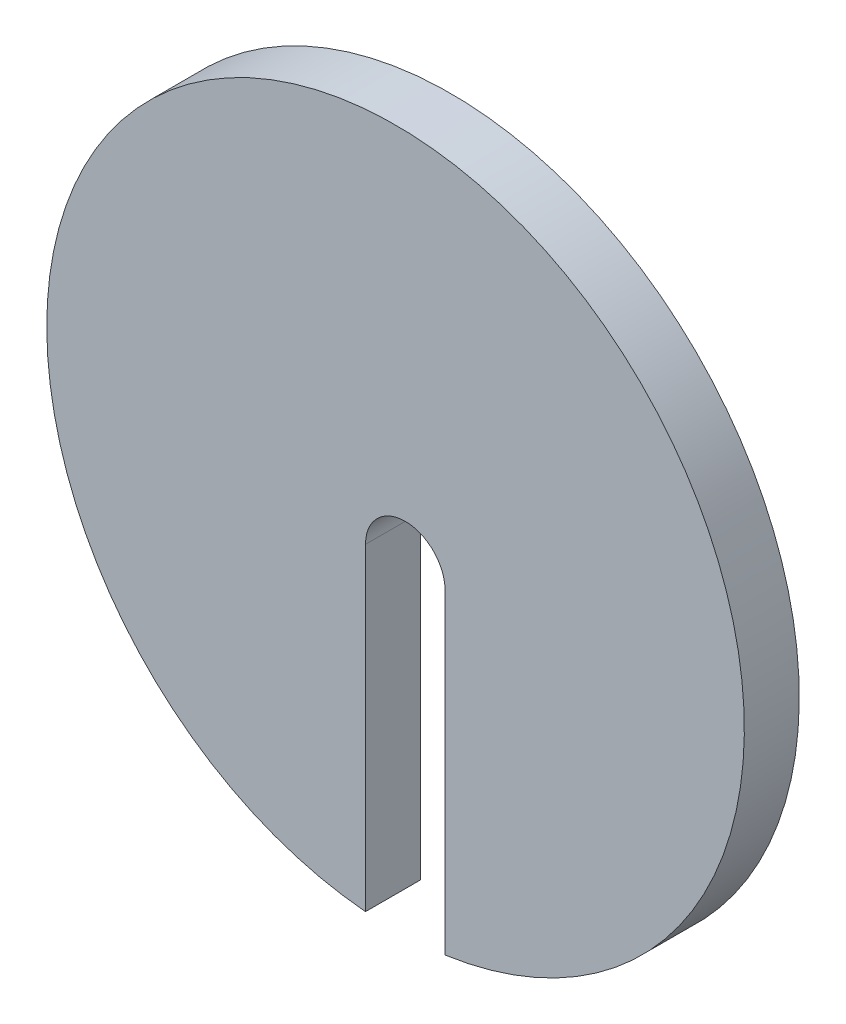
ISO-10303-21;
HEADER;
FILE_DESCRIPTION(('STEP AP214'),'2;1');
FILE_NAME('part.step','',(''),(''),'','','');
FILE_SCHEMA(('AUTOMOTIVE_DESIGN { 1 0 10303 214 1 1 1 1 }'));
ENDSEC;
DATA;
#1=APPLICATION_CONTEXT('core data for automotive mechanical design processes');
#2=APPLICATION_PROTOCOL_DEFINITION('international standard','automotive_design',2000,#1);
#3=PRODUCT_CONTEXT('',#1,'mechanical');
#4=PRODUCT('Part','Part','',(#3));
#5=PRODUCT_RELATED_PRODUCT_CATEGORY('part','',(#4));
#6=PRODUCT_DEFINITION_FORMATION('','',#4);
#7=PRODUCT_DEFINITION_CONTEXT('part definition',#1,'design');
#8=PRODUCT_DEFINITION('design','',#6,#7);
#9=PRODUCT_DEFINITION_SHAPE('','',#8);
#10=(LENGTH_UNIT() NAMED_UNIT(*) SI_UNIT(.MILLI.,.METRE.));
#11=(NAMED_UNIT(*) PLANE_ANGLE_UNIT() SI_UNIT($,.RADIAN.));
#12=(NAMED_UNIT(*) SI_UNIT($,.STERADIAN.) SOLID_ANGLE_UNIT());
#13=UNCERTAINTY_MEASURE_WITH_UNIT(LENGTH_MEASURE(1.E-05),#10,'distance_accuracy_value','');
#14=(GEOMETRIC_REPRESENTATION_CONTEXT(3) GLOBAL_UNCERTAINTY_ASSIGNED_CONTEXT((#13)) GLOBAL_UNIT_ASSIGNED_CONTEXT((#10,
#11,#12)) REPRESENTATION_CONTEXT('',''));
#15=CARTESIAN_POINT('',(0.,0.,0.));
#16=DIRECTION('',(0.,0.,1.));
#17=DIRECTION('',(1.,0.,0.));
#18=AXIS2_PLACEMENT_3D('',#15,#16,#17);
#19=CARTESIAN_POINT('',(0.,0.,10.));
#20=DIRECTION('',(0.,0.,-1.));
#21=DIRECTION('',(-1.,0.,0.));
#22=AXIS2_PLACEMENT_3D('',#19,#20,#21);
#23=CYLINDRICAL_SURFACE('',#22,63.5);
#24=CARTESIAN_POINT('',(0.,0.,0.));
#25=DIRECTION('',(0.,0.,1.));
#26=DIRECTION('',(1.,0.,0.));
#27=AXIS2_PLACEMENT_3D('',#24,#25,#26);
#28=CIRCLE('',#27,63.5);
#29=CARTESIAN_POINT('',(9.01674258292448,-62.8565696899956,0.));
#30=VERTEX_POINT('',#29);
#31=CARTESIAN_POINT('',(-5.4693856696501,-63.2640167899306,0.));
#32=VERTEX_POINT('',#31);
#33=EDGE_CURVE('E36',#30,#32,#28,.T.);
#34=ORIENTED_EDGE('',*,*,#33,.T.);
#35=DIRECTION('',(0.,0.,1.));
#36=VECTOR('',#35,1.);
#37=CARTESIAN_POINT('',(-5.4693856696501,-63.2640167899306,0.));
#38=LINE('',#37,#36);
#39=CARTESIAN_POINT('',(-5.4693856696501,-63.2640167899306,10.));
#40=VERTEX_POINT('',#39);
#41=EDGE_CURVE('E56',#32,#40,#38,.T.);
#42=ORIENTED_EDGE('',*,*,#41,.T.);
#43=CARTESIAN_POINT('',(0.,0.,10.));
#44=DIRECTION('',(0.,0.,1.));
#45=DIRECTION('',(1.,0.,0.));
#46=AXIS2_PLACEMENT_3D('',#43,#44,#45);
#47=CIRCLE('',#46,63.5);
#48=CARTESIAN_POINT('',(9.01674258292448,-62.8565696899956,10.));
#49=VERTEX_POINT('',#48);
#50=EDGE_CURVE('E11',#49,#40,#47,.T.);
#51=ORIENTED_EDGE('',*,*,#50,.F.);
#52=DIRECTION('',(0.,0.,1.));
#53=VECTOR('',#52,1.);
#54=CARTESIAN_POINT('',(9.01674258292448,-62.8565696899956,0.));
#55=LINE('',#54,#53);
#56=EDGE_CURVE('E79',#30,#49,#55,.T.);
#57=ORIENTED_EDGE('',*,*,#56,.F.);
#58=EDGE_LOOP('',(#34,#42,#51,#57));
#59=FACE_BOUND('',#58,.T.);
#60=ADVANCED_FACE('F33',(#59),#23,.T.);
#61=CARTESIAN_POINT('',(0.,0.,10.));
#62=DIRECTION('',(0.,0.,1.));
#63=DIRECTION('',(1.,0.,0.));
#64=AXIS2_PLACEMENT_3D('',#61,#62,#63);
#65=PLANE('',#64);
#66=DIRECTION('',(0.,-1.,0.));
#67=VECTOR('',#66,1.);
#68=CARTESIAN_POINT('',(-5.4693856696501,-63.2640167899306,10.));
#69=LINE('',#68,#67);
#70=CARTESIAN_POINT('',(-5.4693856696501,-5.3426177376888,10.));
#71=VERTEX_POINT('',#70);
#72=EDGE_CURVE('E71',#71,#40,#69,.T.);
#73=ORIENTED_EDGE('',*,*,#72,.F.);
#74=CARTESIAN_POINT('',(1.77367845663719,-5.3426177376888,10.));
#75=DIRECTION('',(0.,0.,1.));
#76=DIRECTION('',(-1.,0.,0.));
#77=AXIS2_PLACEMENT_3D('',#74,#75,#76);
#78=CIRCLE('',#77,7.24306412628729);
#79=CARTESIAN_POINT('',(9.01674258292448,-5.3426177376888,10.));
#80=VERTEX_POINT('',#79);
#81=EDGE_CURVE('E100',#80,#71,#78,.T.);
#82=ORIENTED_EDGE('',*,*,#81,.F.);
#83=DIRECTION('',(0.,1.,0.));
#84=VECTOR('',#83,1.);
#85=CARTESIAN_POINT('',(9.01674258292448,-5.3426177376888,10.));
#86=LINE('',#85,#84);
#87=EDGE_CURVE('E101',#49,#80,#86,.T.);
#88=ORIENTED_EDGE('',*,*,#87,.F.);
#89=ORIENTED_EDGE('',*,*,#50,.T.);
#90=EDGE_LOOP('',(#73,#82,#88,#89));
#91=FACE_BOUND('',#90,.T.);
#92=ADVANCED_FACE('F104',(#91),#65,.T.);
#93=CARTESIAN_POINT('',(0.,0.,0.));
#94=DIRECTION('',(0.,0.,1.));
#95=DIRECTION('',(1.,0.,0.));
#96=AXIS2_PLACEMENT_3D('',#93,#94,#95);
#97=PLANE('',#96);
#98=CARTESIAN_POINT('',(1.77367845663719,-5.3426177376888,0.));
#99=DIRECTION('',(0.,0.,1.));
#100=DIRECTION('',(-1.,0.,0.));
#101=AXIS2_PLACEMENT_3D('',#98,#99,#100);
#102=CIRCLE('',#101,7.24306412628729);
#103=CARTESIAN_POINT('',(9.01674258292448,-5.3426177376888,0.));
#104=VERTEX_POINT('',#103);
#105=CARTESIAN_POINT('',(-5.4693856696501,-5.3426177376888,0.));
#106=VERTEX_POINT('',#105);
#107=EDGE_CURVE('E47',#104,#106,#102,.T.);
#108=ORIENTED_EDGE('',*,*,#107,.T.);
#109=DIRECTION('',(0.,-1.,0.));
#110=VECTOR('',#109,1.);
#111=CARTESIAN_POINT('',(-5.4693856696501,-63.2640167899306,0.));
#112=LINE('',#111,#110);
#113=EDGE_CURVE('E88',#106,#32,#112,.T.);
#114=ORIENTED_EDGE('',*,*,#113,.T.);
#115=ORIENTED_EDGE('',*,*,#33,.F.);
#116=DIRECTION('',(0.,1.,0.));
#117=VECTOR('',#116,1.);
#118=CARTESIAN_POINT('',(9.01674258292448,-5.3426177376888,0.));
#119=LINE('',#118,#117);
#120=EDGE_CURVE('E75',#30,#104,#119,.T.);
#121=ORIENTED_EDGE('',*,*,#120,.T.);
#122=EDGE_LOOP('',(#108,#114,#115,#121));
#123=FACE_BOUND('',#122,.T.);
#124=ADVANCED_FACE('F90',(#123),#97,.F.);
#125=CARTESIAN_POINT('',(-5.4693856696501,-63.2640167899306,0.));
#126=DIRECTION('',(-1.,0.,0.));
#127=DIRECTION('',(0.,0.,1.));
#128=AXIS2_PLACEMENT_3D('',#125,#126,#127);
#129=PLANE('',#128);
#130=ORIENTED_EDGE('',*,*,#72,.T.);
#131=ORIENTED_EDGE('',*,*,#41,.F.);
#132=ORIENTED_EDGE('',*,*,#113,.F.);
#133=DIRECTION('',(0.,0.,1.));
#134=VECTOR('',#133,1.);
#135=CARTESIAN_POINT('',(-5.4693856696501,-5.3426177376888,0.));
#136=LINE('',#135,#134);
#137=EDGE_CURVE('E91',#106,#71,#136,.T.);
#138=ORIENTED_EDGE('',*,*,#137,.T.);
#139=EDGE_LOOP('',(#130,#131,#132,#138));
#140=FACE_BOUND('',#139,.T.);
#141=ADVANCED_FACE('F113',(#140),#129,.F.);
#142=CARTESIAN_POINT('',(1.77367845663719,-5.3426177376888,0.));
#143=DIRECTION('',(0.,0.,1.));
#144=DIRECTION('',(1.,0.,0.));
#145=AXIS2_PLACEMENT_3D('',#142,#143,#144);
#146=CYLINDRICAL_SURFACE('',#145,7.24306412628729);
#147=ORIENTED_EDGE('',*,*,#81,.T.);
#148=ORIENTED_EDGE('',*,*,#137,.F.);
#149=ORIENTED_EDGE('',*,*,#107,.F.);
#150=DIRECTION('',(0.,0.,1.));
#151=VECTOR('',#150,1.);
#152=CARTESIAN_POINT('',(9.01674258292448,-5.3426177376888,0.));
#153=LINE('',#152,#151);
#154=EDGE_CURVE('E81',#104,#80,#153,.T.);
#155=ORIENTED_EDGE('',*,*,#154,.T.);
#156=EDGE_LOOP('',(#147,#148,#149,#155));
#157=FACE_BOUND('',#156,.T.);
#158=ADVANCED_FACE('F98',(#157),#146,.F.);
#159=CARTESIAN_POINT('',(9.01674258292448,-5.3426177376888,0.));
#160=DIRECTION('',(1.,0.,0.));
#161=DIRECTION('',(0.,0.,-1.));
#162=AXIS2_PLACEMENT_3D('',#159,#160,#161);
#163=PLANE('',#162);
#164=ORIENTED_EDGE('',*,*,#87,.T.);
#165=ORIENTED_EDGE('',*,*,#154,.F.);
#166=ORIENTED_EDGE('',*,*,#120,.F.);
#167=ORIENTED_EDGE('',*,*,#56,.T.);
#168=EDGE_LOOP('',(#164,#165,#166,#167));
#169=FACE_BOUND('',#168,.T.);
#170=ADVANCED_FACE('F78',(#169),#163,.F.);
#171=CLOSED_SHELL('',(#60,#92,#124,#141,#158,#170));
#172=MANIFOLD_SOLID_BREP('B2',#171);
#173=ADVANCED_BREP_SHAPE_REPRESENTATION('',(#18,#172),#14);
#174=SHAPE_DEFINITION_REPRESENTATION(#9,#173);
ENDSEC;
END-ISO-10303-21;
